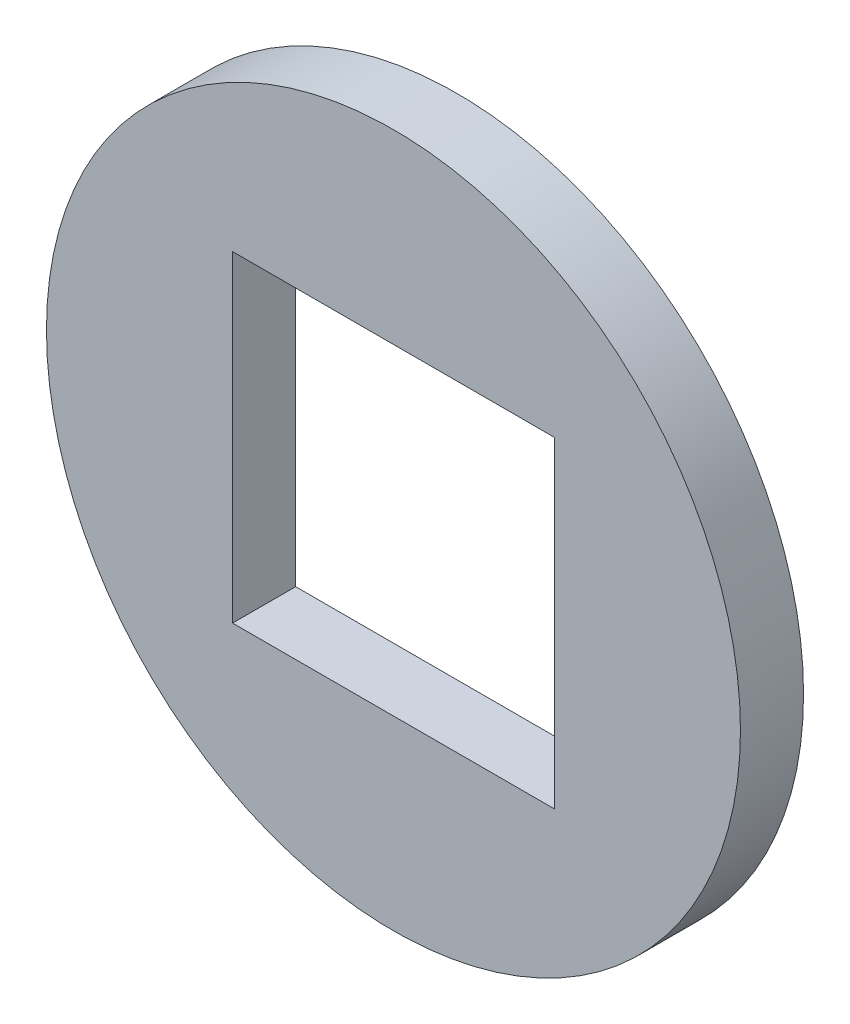
ISO-10303-21;
HEADER;
FILE_DESCRIPTION(('STEP AP214'),'2;1');
FILE_NAME('part.step','',(''),(''),'','','');
FILE_SCHEMA(('AUTOMOTIVE_DESIGN { 1 0 10303 214 1 1 1 1 }'));
ENDSEC;
DATA;
#1=APPLICATION_CONTEXT('core data for automotive mechanical design processes');
#2=APPLICATION_PROTOCOL_DEFINITION('international standard','automotive_design',2000,#1);
#3=PRODUCT_CONTEXT('',#1,'mechanical');
#4=PRODUCT('Part','Part','',(#3));
#5=PRODUCT_RELATED_PRODUCT_CATEGORY('part','',(#4));
#6=PRODUCT_DEFINITION_FORMATION('','',#4);
#7=PRODUCT_DEFINITION_CONTEXT('part definition',#1,'design');
#8=PRODUCT_DEFINITION('design','',#6,#7);
#9=PRODUCT_DEFINITION_SHAPE('','',#8);
#10=(LENGTH_UNIT() NAMED_UNIT(*) SI_UNIT(.MILLI.,.METRE.));
#11=(NAMED_UNIT(*) PLANE_ANGLE_UNIT() SI_UNIT($,.RADIAN.));
#12=(NAMED_UNIT(*) SI_UNIT($,.STERADIAN.) SOLID_ANGLE_UNIT());
#13=UNCERTAINTY_MEASURE_WITH_UNIT(LENGTH_MEASURE(1.E-05),#10,'distance_accuracy_value','');
#14=(GEOMETRIC_REPRESENTATION_CONTEXT(3) GLOBAL_UNCERTAINTY_ASSIGNED_CONTEXT((#13)) GLOBAL_UNIT_ASSIGNED_CONTEXT((#10,
#11,#12)) REPRESENTATION_CONTEXT('',''));
#15=CARTESIAN_POINT('',(0.,0.,0.));
#16=DIRECTION('',(0.,0.,1.));
#17=DIRECTION('',(1.,0.,0.));
#18=AXIS2_PLACEMENT_3D('',#15,#16,#17);
#19=CARTESIAN_POINT('',(0.,0.,2.));
#20=DIRECTION('',(0.,0.,1.));
#21=DIRECTION('',(1.,0.,0.));
#22=AXIS2_PLACEMENT_3D('',#19,#20,#21);
#23=PLANE('',#22);
#24=CARTESIAN_POINT('',(0.,0.,2.));
#25=DIRECTION('',(0.,0.,1.));
#26=DIRECTION('',(1.,0.,0.));
#27=AXIS2_PLACEMENT_3D('',#24,#25,#26);
#28=CIRCLE('',#27,11.);
#29=CARTESIAN_POINT('',(11.,0.,2.));
#30=VERTEX_POINT('',#29);
#31=EDGE_CURVE('E11',#30,#30,#28,.T.);
#32=ORIENTED_EDGE('',*,*,#31,.T.);
#33=EDGE_LOOP('',(#32));
#34=FACE_BOUND('',#33,.T.);
#35=DIRECTION('',(-1.,0.,0.));
#36=VECTOR('',#35,1.);
#37=CARTESIAN_POINT('',(-5.1,5.1,2.));
#38=LINE('',#37,#36);
#39=CARTESIAN_POINT('',(5.1,5.1,2.));
#40=VERTEX_POINT('',#39);
#41=CARTESIAN_POINT('',(-5.1,5.1,2.));
#42=VERTEX_POINT('',#41);
#43=EDGE_CURVE('E81',#40,#42,#38,.T.);
#44=ORIENTED_EDGE('',*,*,#43,.F.);
#45=DIRECTION('',(0.,1.,0.));
#46=VECTOR('',#45,1.);
#47=CARTESIAN_POINT('',(5.1,-5.1,2.));
#48=LINE('',#47,#46);
#49=CARTESIAN_POINT('',(5.1,-5.1,2.));
#50=VERTEX_POINT('',#49);
#51=EDGE_CURVE('E73',#50,#40,#48,.T.);
#52=ORIENTED_EDGE('',*,*,#51,.F.);
#53=DIRECTION('',(1.,0.,0.));
#54=VECTOR('',#53,1.);
#55=CARTESIAN_POINT('',(-5.1,-5.1,2.));
#56=LINE('',#55,#54);
#57=CARTESIAN_POINT('',(-5.1,-5.1,2.));
#58=VERTEX_POINT('',#57);
#59=EDGE_CURVE('E94',#58,#50,#56,.T.);
#60=ORIENTED_EDGE('',*,*,#59,.F.);
#61=DIRECTION('',(0.,-1.,0.));
#62=VECTOR('',#61,1.);
#63=CARTESIAN_POINT('',(-5.1,-5.1,2.));
#64=LINE('',#63,#62);
#65=EDGE_CURVE('E92',#42,#58,#64,.T.);
#66=ORIENTED_EDGE('',*,*,#65,.F.);
#67=EDGE_LOOP('',(#44,#52,#60,#66));
#68=FACE_BOUND('',#67,.T.);
#69=ADVANCED_FACE('F32',(#34,#68),#23,.T.);
#70=CARTESIAN_POINT('',(0.,0.,0.));
#71=DIRECTION('',(0.,0.,1.));
#72=DIRECTION('',(1.,0.,0.));
#73=AXIS2_PLACEMENT_3D('',#70,#71,#72);
#74=PLANE('',#73);
#75=CARTESIAN_POINT('',(0.,0.,0.));
#76=DIRECTION('',(0.,0.,1.));
#77=DIRECTION('',(1.,0.,0.));
#78=AXIS2_PLACEMENT_3D('',#75,#76,#77);
#79=CIRCLE('',#78,11.);
#80=CARTESIAN_POINT('',(11.,0.,0.));
#81=VERTEX_POINT('',#80);
#82=EDGE_CURVE('E36',#81,#81,#79,.T.);
#83=ORIENTED_EDGE('',*,*,#82,.F.);
#84=EDGE_LOOP('',(#83));
#85=FACE_BOUND('',#84,.T.);
#86=DIRECTION('',(0.,1.,0.));
#87=VECTOR('',#86,1.);
#88=CARTESIAN_POINT('',(5.1,-5.1,0.));
#89=LINE('',#88,#87);
#90=CARTESIAN_POINT('',(5.1,-5.1,0.));
#91=VERTEX_POINT('',#90);
#92=CARTESIAN_POINT('',(5.1,5.1,0.));
#93=VERTEX_POINT('',#92);
#94=EDGE_CURVE('E55',#91,#93,#89,.T.);
#95=ORIENTED_EDGE('',*,*,#94,.T.);
#96=DIRECTION('',(-1.,0.,0.));
#97=VECTOR('',#96,1.);
#98=CARTESIAN_POINT('',(-5.1,5.1,0.));
#99=LINE('',#98,#97);
#100=CARTESIAN_POINT('',(-5.1,5.1,0.));
#101=VERTEX_POINT('',#100);
#102=EDGE_CURVE('E88',#93,#101,#99,.T.);
#103=ORIENTED_EDGE('',*,*,#102,.T.);
#104=DIRECTION('',(0.,-1.,0.));
#105=VECTOR('',#104,1.);
#106=CARTESIAN_POINT('',(-5.1,-5.1,0.));
#107=LINE('',#106,#105);
#108=CARTESIAN_POINT('',(-5.1,-5.1,0.));
#109=VERTEX_POINT('',#108);
#110=EDGE_CURVE('E100',#101,#109,#107,.T.);
#111=ORIENTED_EDGE('',*,*,#110,.T.);
#112=DIRECTION('',(1.,0.,0.));
#113=VECTOR('',#112,1.);
#114=CARTESIAN_POINT('',(-5.1,-5.1,0.));
#115=LINE('',#114,#113);
#116=EDGE_CURVE('E82',#109,#91,#115,.T.);
#117=ORIENTED_EDGE('',*,*,#116,.T.);
#118=EDGE_LOOP('',(#95,#103,#111,#117));
#119=FACE_BOUND('',#118,.T.);
#120=ADVANCED_FACE('F111',(#85,#119),#74,.F.);
#121=CARTESIAN_POINT('',(0.,0.,2.));
#122=DIRECTION('',(0.,0.,-1.));
#123=DIRECTION('',(-1.,0.,0.));
#124=AXIS2_PLACEMENT_3D('',#121,#122,#123);
#125=CYLINDRICAL_SURFACE('',#124,11.);
#126=ORIENTED_EDGE('',*,*,#31,.F.);
#127=EDGE_LOOP('',(#126));
#128=FACE_BOUND('',#127,.T.);
#129=ORIENTED_EDGE('',*,*,#82,.T.);
#130=EDGE_LOOP('',(#129));
#131=FACE_BOUND('',#130,.T.);
#132=ADVANCED_FACE('F34',(#128,#131),#125,.T.);
#133=CARTESIAN_POINT('',(5.1,-5.1,2.));
#134=DIRECTION('',(-1.,0.,0.));
#135=DIRECTION('',(0.,0.,1.));
#136=AXIS2_PLACEMENT_3D('',#133,#134,#135);
#137=PLANE('',#136);
#138=ORIENTED_EDGE('',*,*,#94,.F.);
#139=DIRECTION('',(0.,0.,-1.));
#140=VECTOR('',#139,1.);
#141=CARTESIAN_POINT('',(5.1,-5.1,2.));
#142=LINE('',#141,#140);
#143=EDGE_CURVE('E77',#50,#91,#142,.T.);
#144=ORIENTED_EDGE('',*,*,#143,.F.);
#145=ORIENTED_EDGE('',*,*,#51,.T.);
#146=DIRECTION('',(0.,0.,-1.));
#147=VECTOR('',#146,1.);
#148=CARTESIAN_POINT('',(5.1,5.1,2.));
#149=LINE('',#148,#147);
#150=EDGE_CURVE('E76',#40,#93,#149,.T.);
#151=ORIENTED_EDGE('',*,*,#150,.T.);
#152=EDGE_LOOP('',(#138,#144,#145,#151));
#153=FACE_BOUND('',#152,.T.);
#154=ADVANCED_FACE('F75',(#153),#137,.T.);
#155=CARTESIAN_POINT('',(-5.1,5.1,2.));
#156=DIRECTION('',(0.,-1.,0.));
#157=DIRECTION('',(0.,0.,-1.));
#158=AXIS2_PLACEMENT_3D('',#155,#156,#157);
#159=PLANE('',#158);
#160=ORIENTED_EDGE('',*,*,#102,.F.);
#161=ORIENTED_EDGE('',*,*,#150,.F.);
#162=ORIENTED_EDGE('',*,*,#43,.T.);
#163=DIRECTION('',(0.,0.,-1.));
#164=VECTOR('',#163,1.);
#165=CARTESIAN_POINT('',(-5.1,5.1,2.));
#166=LINE('',#165,#164);
#167=EDGE_CURVE('E89',#42,#101,#166,.T.);
#168=ORIENTED_EDGE('',*,*,#167,.T.);
#169=EDGE_LOOP('',(#160,#161,#162,#168));
#170=FACE_BOUND('',#169,.T.);
#171=ADVANCED_FACE('F85',(#170),#159,.T.);
#172=CARTESIAN_POINT('',(-5.1,-5.1,2.));
#173=DIRECTION('',(1.,0.,0.));
#174=DIRECTION('',(0.,0.,-1.));
#175=AXIS2_PLACEMENT_3D('',#172,#173,#174);
#176=PLANE('',#175);
#177=ORIENTED_EDGE('',*,*,#110,.F.);
#178=ORIENTED_EDGE('',*,*,#167,.F.);
#179=ORIENTED_EDGE('',*,*,#65,.T.);
#180=DIRECTION('',(0.,0.,-1.));
#181=VECTOR('',#180,1.);
#182=CARTESIAN_POINT('',(-5.1,-5.1,2.));
#183=LINE('',#182,#181);
#184=EDGE_CURVE('E47',#58,#109,#183,.T.);
#185=ORIENTED_EDGE('',*,*,#184,.T.);
#186=EDGE_LOOP('',(#177,#178,#179,#185));
#187=FACE_BOUND('',#186,.T.);
#188=ADVANCED_FACE('F109',(#187),#176,.T.);
#189=CARTESIAN_POINT('',(-5.1,-5.1,2.));
#190=DIRECTION('',(0.,1.,0.));
#191=DIRECTION('',(0.,0.,1.));
#192=AXIS2_PLACEMENT_3D('',#189,#190,#191);
#193=PLANE('',#192);
#194=ORIENTED_EDGE('',*,*,#116,.F.);
#195=ORIENTED_EDGE('',*,*,#184,.F.);
#196=ORIENTED_EDGE('',*,*,#59,.T.);
#197=ORIENTED_EDGE('',*,*,#143,.T.);
#198=EDGE_LOOP('',(#194,#195,#196,#197));
#199=FACE_BOUND('',#198,.T.);
#200=ADVANCED_FACE('F112',(#199),#193,.T.);
#201=CLOSED_SHELL('',(#69,#120,#132,#154,#171,#188,#200));
#202=MANIFOLD_SOLID_BREP('B2',#201);
#203=ADVANCED_BREP_SHAPE_REPRESENTATION('',(#18,#202),#14);
#204=SHAPE_DEFINITION_REPRESENTATION(#9,#203);
ENDSEC;
END-ISO-10303-21;
